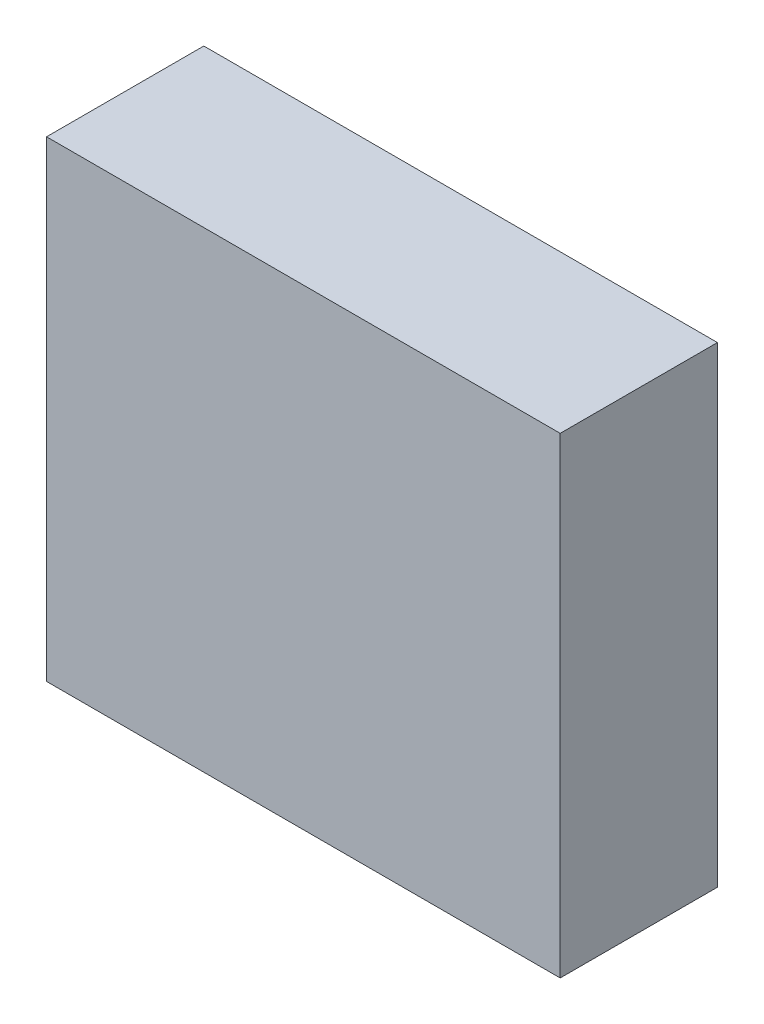
ISO-10303-21;
HEADER;
FILE_DESCRIPTION(('STEP AP214'),'2;1');
FILE_NAME('part.step','',(''),(''),'','','');
FILE_SCHEMA(('AUTOMOTIVE_DESIGN { 1 0 10303 214 1 1 1 1 }'));
ENDSEC;
DATA;
#1=APPLICATION_CONTEXT('core data for automotive mechanical design processes');
#2=APPLICATION_PROTOCOL_DEFINITION('international standard','automotive_design',2000,#1);
#3=PRODUCT_CONTEXT('',#1,'mechanical');
#4=PRODUCT('Part','Part','',(#3));
#5=PRODUCT_RELATED_PRODUCT_CATEGORY('part','',(#4));
#6=PRODUCT_DEFINITION_FORMATION('','',#4);
#7=PRODUCT_DEFINITION_CONTEXT('part definition',#1,'design');
#8=PRODUCT_DEFINITION('design','',#6,#7);
#9=PRODUCT_DEFINITION_SHAPE('','',#8);
#10=(LENGTH_UNIT() NAMED_UNIT(*) SI_UNIT(.MILLI.,.METRE.));
#11=(NAMED_UNIT(*) PLANE_ANGLE_UNIT() SI_UNIT($,.RADIAN.));
#12=(NAMED_UNIT(*) SI_UNIT($,.STERADIAN.) SOLID_ANGLE_UNIT());
#13=UNCERTAINTY_MEASURE_WITH_UNIT(LENGTH_MEASURE(1.E-05),#10,'distance_accuracy_value','');
#14=(GEOMETRIC_REPRESENTATION_CONTEXT(3) GLOBAL_UNCERTAINTY_ASSIGNED_CONTEXT((#13)) GLOBAL_UNIT_ASSIGNED_CONTEXT((#10,
#11,#12)) REPRESENTATION_CONTEXT('',''));
#15=CARTESIAN_POINT('',(0.,0.,0.));
#16=DIRECTION('',(0.,0.,1.));
#17=DIRECTION('',(1.,0.,0.));
#18=AXIS2_PLACEMENT_3D('',#15,#16,#17);
#19=CARTESIAN_POINT('',(49.,90.,15.));
#20=DIRECTION('',(-1.,0.,0.));
#21=DIRECTION('',(0.,0.,1.));
#22=AXIS2_PLACEMENT_3D('',#19,#20,#21);
#23=PLANE('',#22);
#24=DIRECTION('',(0.,0.,-1.));
#25=VECTOR('',#24,1.);
#26=CARTESIAN_POINT('',(49.,0.,15.));
#27=LINE('',#26,#25);
#28=CARTESIAN_POINT('',(49.,0.,15.));
#29=VERTEX_POINT('',#28);
#30=CARTESIAN_POINT('',(49.,0.,-15.));
#31=VERTEX_POINT('',#30);
#32=EDGE_CURVE('E96',#29,#31,#27,.T.);
#33=ORIENTED_EDGE('',*,*,#32,.T.);
#34=DIRECTION('',(0.,-1.,0.));
#35=VECTOR('',#34,1.);
#36=CARTESIAN_POINT('',(49.,90.,-15.));
#37=LINE('',#36,#35);
#38=CARTESIAN_POINT('',(49.,90.,-15.));
#39=VERTEX_POINT('',#38);
#40=EDGE_CURVE('E11',#39,#31,#37,.T.);
#41=ORIENTED_EDGE('',*,*,#40,.F.);
#42=DIRECTION('',(0.,0.,-1.));
#43=VECTOR('',#42,1.);
#44=CARTESIAN_POINT('',(49.,90.,15.));
#45=LINE('',#44,#43);
#46=CARTESIAN_POINT('',(49.,90.,15.));
#47=VERTEX_POINT('',#46);
#48=EDGE_CURVE('E84',#47,#39,#45,.T.);
#49=ORIENTED_EDGE('',*,*,#48,.F.);
#50=DIRECTION('',(0.,-1.,0.));
#51=VECTOR('',#50,1.);
#52=CARTESIAN_POINT('',(49.,90.,15.));
#53=LINE('',#52,#51);
#54=EDGE_CURVE('E92',#47,#29,#53,.T.);
#55=ORIENTED_EDGE('',*,*,#54,.T.);
#56=EDGE_LOOP('',(#33,#41,#49,#55));
#57=FACE_BOUND('',#56,.T.);
#58=ADVANCED_FACE('F33',(#57),#23,.F.);
#59=CARTESIAN_POINT('',(-49.,90.,-15.));
#60=DIRECTION('',(0.,0.,1.));
#61=DIRECTION('',(1.,0.,0.));
#62=AXIS2_PLACEMENT_3D('',#59,#60,#61);
#63=PLANE('',#62);
#64=DIRECTION('',(-1.,0.,0.));
#65=VECTOR('',#64,1.);
#66=CARTESIAN_POINT('',(-49.,0.,-15.));
#67=LINE('',#66,#65);
#68=CARTESIAN_POINT('',(-49.,0.,-15.));
#69=VERTEX_POINT('',#68);
#70=EDGE_CURVE('E88',#31,#69,#67,.T.);
#71=ORIENTED_EDGE('',*,*,#70,.T.);
#72=DIRECTION('',(0.,-1.,0.));
#73=VECTOR('',#72,1.);
#74=CARTESIAN_POINT('',(-49.,90.,-15.));
#75=LINE('',#74,#73);
#76=CARTESIAN_POINT('',(-49.,90.,-15.));
#77=VERTEX_POINT('',#76);
#78=EDGE_CURVE('E41',#77,#69,#75,.T.);
#79=ORIENTED_EDGE('',*,*,#78,.F.);
#80=DIRECTION('',(-1.,0.,0.));
#81=VECTOR('',#80,1.);
#82=CARTESIAN_POINT('',(-49.,90.,-15.));
#83=LINE('',#82,#81);
#84=EDGE_CURVE('E79',#39,#77,#83,.T.);
#85=ORIENTED_EDGE('',*,*,#84,.F.);
#86=ORIENTED_EDGE('',*,*,#40,.T.);
#87=EDGE_LOOP('',(#71,#79,#85,#86));
#88=FACE_BOUND('',#87,.T.);
#89=ADVANCED_FACE('F87',(#88),#63,.F.);
#90=CARTESIAN_POINT('',(-49.,90.,15.));
#91=DIRECTION('',(1.,0.,0.));
#92=DIRECTION('',(0.,0.,-1.));
#93=AXIS2_PLACEMENT_3D('',#90,#91,#92);
#94=PLANE('',#93);
#95=DIRECTION('',(0.,0.,1.));
#96=VECTOR('',#95,1.);
#97=CARTESIAN_POINT('',(-49.,0.,15.));
#98=LINE('',#97,#96);
#99=CARTESIAN_POINT('',(-49.,0.,15.));
#100=VERTEX_POINT('',#99);
#101=EDGE_CURVE('E66',#69,#100,#98,.T.);
#102=ORIENTED_EDGE('',*,*,#101,.T.);
#103=DIRECTION('',(0.,-1.,0.));
#104=VECTOR('',#103,1.);
#105=CARTESIAN_POINT('',(-49.,90.,15.));
#106=LINE('',#105,#104);
#107=CARTESIAN_POINT('',(-49.,90.,15.));
#108=VERTEX_POINT('',#107);
#109=EDGE_CURVE('E89',#108,#100,#106,.T.);
#110=ORIENTED_EDGE('',*,*,#109,.F.);
#111=DIRECTION('',(0.,0.,1.));
#112=VECTOR('',#111,1.);
#113=CARTESIAN_POINT('',(-49.,90.,15.));
#114=LINE('',#113,#112);
#115=EDGE_CURVE('E82',#77,#108,#114,.T.);
#116=ORIENTED_EDGE('',*,*,#115,.F.);
#117=ORIENTED_EDGE('',*,*,#78,.T.);
#118=EDGE_LOOP('',(#102,#110,#116,#117));
#119=FACE_BOUND('',#118,.T.);
#120=ADVANCED_FACE('F90',(#119),#94,.F.);
#121=CARTESIAN_POINT('',(-49.,90.,15.));
#122=DIRECTION('',(0.,0.,-1.));
#123=DIRECTION('',(-1.,0.,0.));
#124=AXIS2_PLACEMENT_3D('',#121,#122,#123);
#125=PLANE('',#124);
#126=DIRECTION('',(1.,0.,0.));
#127=VECTOR('',#126,1.);
#128=CARTESIAN_POINT('',(-49.,0.,15.));
#129=LINE('',#128,#127);
#130=EDGE_CURVE('E72',#100,#29,#129,.T.);
#131=ORIENTED_EDGE('',*,*,#130,.T.);
#132=ORIENTED_EDGE('',*,*,#54,.F.);
#133=DIRECTION('',(1.,0.,0.));
#134=VECTOR('',#133,1.);
#135=CARTESIAN_POINT('',(-49.,90.,15.));
#136=LINE('',#135,#134);
#137=EDGE_CURVE('E49',#108,#47,#136,.T.);
#138=ORIENTED_EDGE('',*,*,#137,.F.);
#139=ORIENTED_EDGE('',*,*,#109,.T.);
#140=EDGE_LOOP('',(#131,#132,#138,#139));
#141=FACE_BOUND('',#140,.T.);
#142=ADVANCED_FACE('F103',(#141),#125,.F.);
#143=CARTESIAN_POINT('',(0.,90.,0.));
#144=DIRECTION('',(0.,-1.,0.));
#145=DIRECTION('',(0.,0.,-1.));
#146=AXIS2_PLACEMENT_3D('',#143,#144,#145);
#147=PLANE('',#146);
#148=ORIENTED_EDGE('',*,*,#48,.T.);
#149=ORIENTED_EDGE('',*,*,#84,.T.);
#150=ORIENTED_EDGE('',*,*,#115,.T.);
#151=ORIENTED_EDGE('',*,*,#137,.T.);
#152=EDGE_LOOP('',(#148,#149,#150,#151));
#153=FACE_BOUND('',#152,.T.);
#154=ADVANCED_FACE('F80',(#153),#147,.F.);
#155=CARTESIAN_POINT('',(0.,0.,0.));
#156=DIRECTION('',(0.,-1.,0.));
#157=DIRECTION('',(0.,0.,-1.));
#158=AXIS2_PLACEMENT_3D('',#155,#156,#157);
#159=PLANE('',#158);
#160=ORIENTED_EDGE('',*,*,#32,.F.);
#161=ORIENTED_EDGE('',*,*,#130,.F.);
#162=ORIENTED_EDGE('',*,*,#101,.F.);
#163=ORIENTED_EDGE('',*,*,#70,.F.);
#164=EDGE_LOOP('',(#160,#161,#162,#163));
#165=FACE_BOUND('',#164,.T.);
#166=ADVANCED_FACE('F106',(#165),#159,.T.);
#167=CLOSED_SHELL('',(#58,#89,#120,#142,#154,#166));
#168=MANIFOLD_SOLID_BREP('B2',#167);
#169=ADVANCED_BREP_SHAPE_REPRESENTATION('',(#18,#168),#14);
#170=SHAPE_DEFINITION_REPRESENTATION(#9,#169);
ENDSEC;
END-ISO-10303-21;
